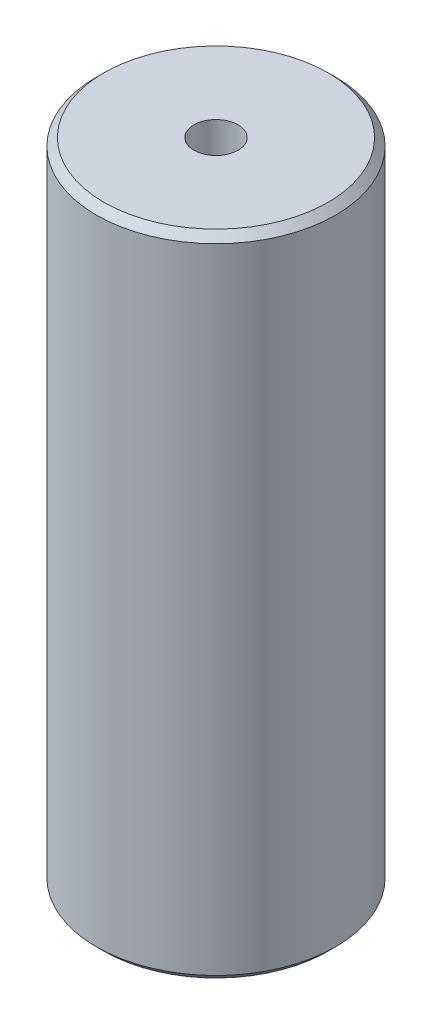
ISO-10303-21;
HEADER;
FILE_DESCRIPTION(('STEP AP214'),'2;1');
FILE_NAME('part.step','',(''),(''),'','','');
FILE_SCHEMA(('AUTOMOTIVE_DESIGN { 1 0 10303 214 1 1 1 1 }'));
ENDSEC;
DATA;
#1=APPLICATION_CONTEXT('core data for automotive mechanical design processes');
#2=APPLICATION_PROTOCOL_DEFINITION('international standard','automotive_design',2000,#1);
#3=PRODUCT_CONTEXT('',#1,'mechanical');
#4=PRODUCT('Part','Part','',(#3));
#5=PRODUCT_RELATED_PRODUCT_CATEGORY('part','',(#4));
#6=PRODUCT_DEFINITION_FORMATION('','',#4);
#7=PRODUCT_DEFINITION_CONTEXT('part definition',#1,'design');
#8=PRODUCT_DEFINITION('design','',#6,#7);
#9=PRODUCT_DEFINITION_SHAPE('','',#8);
#10=(LENGTH_UNIT() NAMED_UNIT(*) SI_UNIT(.MILLI.,.METRE.));
#11=(NAMED_UNIT(*) PLANE_ANGLE_UNIT() SI_UNIT($,.RADIAN.));
#12=(NAMED_UNIT(*) SI_UNIT($,.STERADIAN.) SOLID_ANGLE_UNIT());
#13=UNCERTAINTY_MEASURE_WITH_UNIT(LENGTH_MEASURE(1.E-05),#10,'distance_accuracy_value','');
#14=(GEOMETRIC_REPRESENTATION_CONTEXT(3) GLOBAL_UNCERTAINTY_ASSIGNED_CONTEXT((#13)) GLOBAL_UNIT_ASSIGNED_CONTEXT((#10,
#11,#12)) REPRESENTATION_CONTEXT('',''));
#15=CARTESIAN_POINT('',(0.,0.,0.));
#16=DIRECTION('',(0.,0.,1.));
#17=DIRECTION('',(1.,0.,0.));
#18=AXIS2_PLACEMENT_3D('',#15,#16,#17);
#19=CARTESIAN_POINT('',(0.,27.1202271621704,0.));
#20=DIRECTION('',(0.,-1.,0.));
#21=DIRECTION('',(0.,0.,-1.));
#22=AXIS2_PLACEMENT_3D('',#19,#20,#21);
#23=CYLINDRICAL_SURFACE('',#22,5.);
#24=CARTESIAN_POINT('',(0.,26.8097962447641,0.));
#25=DIRECTION('',(0.,1.,0.));
#26=DIRECTION('',(0.,0.,1.));
#27=AXIS2_PLACEMENT_3D('',#24,#25,#26);
#28=CIRCLE('',#27,5.);
#29=CARTESIAN_POINT('',(0.,26.8097962447641,5.));
#30=VERTEX_POINT('',#29);
#31=EDGE_CURVE('E50',#30,#30,#28,.F.);
#32=ORIENTED_EDGE('',*,*,#31,.T.);
#33=EDGE_LOOP('',(#32));
#34=FACE_BOUND('',#33,.T.);
#35=CARTESIAN_POINT('',(0.,0.310430917406315,0.));
#36=DIRECTION('',(0.,1.,0.));
#37=DIRECTION('',(0.,0.,1.));
#38=AXIS2_PLACEMENT_3D('',#35,#36,#37);
#39=CIRCLE('',#38,5.);
#40=CARTESIAN_POINT('',(0.,0.310430917406315,5.));
#41=VERTEX_POINT('',#40);
#42=EDGE_CURVE('E51',#41,#41,#39,.T.);
#43=ORIENTED_EDGE('',*,*,#42,.T.);
#44=EDGE_LOOP('',(#43));
#45=FACE_BOUND('',#44,.T.);
#46=ADVANCED_FACE('F39',(#34,#45),#23,.T.);
#47=CARTESIAN_POINT('',(0.,27.1202271621704,0.));
#48=DIRECTION('',(0.,1.,0.));
#49=DIRECTION('',(0.,0.,1.));
#50=AXIS2_PLACEMENT_3D('',#47,#48,#49);
#51=PLANE('',#50);
#52=CARTESIAN_POINT('',(0.,27.1202271621704,0.));
#53=DIRECTION('',(0.,1.,0.));
#54=DIRECTION('',(0.,0.,1.));
#55=AXIS2_PLACEMENT_3D('',#52,#53,#54);
#56=CIRCLE('',#55,4.68956908259368);
#57=CARTESIAN_POINT('',(0.,27.1202271621704,4.68956908259368));
#58=VERTEX_POINT('',#57);
#59=EDGE_CURVE('E54',#58,#58,#56,.T.);
#60=ORIENTED_EDGE('',*,*,#59,.T.);
#61=EDGE_LOOP('',(#60));
#62=FACE_BOUND('',#61,.T.);
#63=CARTESIAN_POINT('',(0.,27.1202271621704,0.));
#64=DIRECTION('',(0.,1.,0.));
#65=DIRECTION('',(0.,0.,1.));
#66=AXIS2_PLACEMENT_3D('',#63,#64,#65);
#67=CIRCLE('',#66,0.922948922283498);
#68=CARTESIAN_POINT('',(0.,27.1202271621704,0.922948922283498));
#69=VERTEX_POINT('',#68);
#70=EDGE_CURVE('E58',#69,#69,#67,.T.);
#71=ORIENTED_EDGE('',*,*,#70,.F.);
#72=EDGE_LOOP('',(#71));
#73=FACE_BOUND('',#72,.T.);
#74=ADVANCED_FACE('F69',(#62,#73),#51,.T.);
#75=CARTESIAN_POINT('',(0.,0.,0.));
#76=DIRECTION('',(0.,1.,0.));
#77=DIRECTION('',(0.,0.,1.));
#78=AXIS2_PLACEMENT_3D('',#75,#76,#77);
#79=PLANE('',#78);
#80=CARTESIAN_POINT('',(0.,0.,0.));
#81=DIRECTION('',(0.,1.,0.));
#82=DIRECTION('',(0.,0.,1.));
#83=AXIS2_PLACEMENT_3D('',#80,#81,#82);
#84=CIRCLE('',#83,4.68956908259369);
#85=CARTESIAN_POINT('',(0.,0.,4.68956908259369));
#86=VERTEX_POINT('',#85);
#87=EDGE_CURVE('E10',#86,#86,#84,.F.);
#88=ORIENTED_EDGE('',*,*,#87,.T.);
#89=EDGE_LOOP('',(#88));
#90=FACE_BOUND('',#89,.T.);
#91=CARTESIAN_POINT('',(0.,0.,0.));
#92=DIRECTION('',(0.,1.,0.));
#93=DIRECTION('',(0.,0.,1.));
#94=AXIS2_PLACEMENT_3D('',#91,#92,#93);
#95=CIRCLE('',#94,0.922948922283498);
#96=CARTESIAN_POINT('',(0.,0.,0.922948922283498));
#97=VERTEX_POINT('',#96);
#98=EDGE_CURVE('E63',#97,#97,#95,.T.);
#99=ORIENTED_EDGE('',*,*,#98,.T.);
#100=EDGE_LOOP('',(#99));
#101=FACE_BOUND('',#100,.T.);
#102=ADVANCED_FACE('F75',(#90,#101),#79,.F.);
#103=CARTESIAN_POINT('',(0.,27.1202271621704,0.));
#104=DIRECTION('',(0.,-1.,0.));
#105=DIRECTION('',(0.,0.,-1.));
#106=AXIS2_PLACEMENT_3D('',#103,#104,#105);
#107=CYLINDRICAL_SURFACE('',#106,0.922948922283498);
#108=ORIENTED_EDGE('',*,*,#70,.T.);
#109=EDGE_LOOP('',(#108));
#110=FACE_BOUND('',#109,.T.);
#111=ORIENTED_EDGE('',*,*,#98,.F.);
#112=EDGE_LOOP('',(#111));
#113=FACE_BOUND('',#112,.T.);
#114=ADVANCED_FACE('F70',(#110,#113),#107,.F.);
#115=CARTESIAN_POINT('',(0.,27.1202271621704,0.));
#116=DIRECTION('',(0.,-1.,0.));
#117=DIRECTION('',(0.,0.,-1.));
#118=AXIS2_PLACEMENT_3D('',#115,#116,#117);
#119=CONICAL_SURFACE('',#118,4.68956908259368,0.785398163397441);
#120=ORIENTED_EDGE('',*,*,#31,.F.);
#121=EDGE_LOOP('',(#120));
#122=FACE_BOUND('',#121,.T.);
#123=ORIENTED_EDGE('',*,*,#59,.F.);
#124=EDGE_LOOP('',(#123));
#125=FACE_BOUND('',#124,.T.);
#126=ADVANCED_FACE('F81',(#122,#125),#119,.T.);
#127=CARTESIAN_POINT('',(0.,0.310430917406315,0.));
#128=DIRECTION('',(0.,1.,0.));
#129=DIRECTION('',(0.,0.,1.));
#130=AXIS2_PLACEMENT_3D('',#127,#128,#129);
#131=CONICAL_SURFACE('',#130,5.,0.785398163397447);
#132=ORIENTED_EDGE('',*,*,#87,.F.);
#133=EDGE_LOOP('',(#132));
#134=FACE_BOUND('',#133,.T.);
#135=ORIENTED_EDGE('',*,*,#42,.F.);
#136=EDGE_LOOP('',(#135));
#137=FACE_BOUND('',#136,.T.);
#138=ADVANCED_FACE('F45',(#134,#137),#131,.T.);
#139=CLOSED_SHELL('',(#46,#74,#102,#114,#126,#138));
#140=MANIFOLD_SOLID_BREP('B2',#139);
#141=ADVANCED_BREP_SHAPE_REPRESENTATION('',(#18,#140),#14);
#142=SHAPE_DEFINITION_REPRESENTATION(#9,#141);
ENDSEC;
END-ISO-10303-21;
